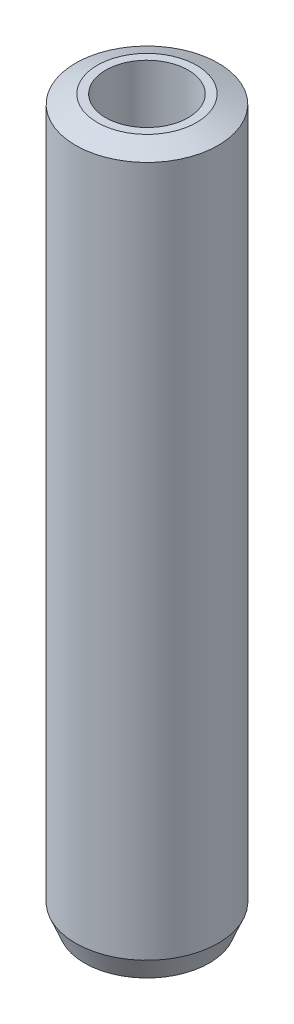
ISO-10303-21;
HEADER;
FILE_DESCRIPTION(('STEP AP214'),'2;1');
FILE_NAME('part.step','',(''),(''),'','','');
FILE_SCHEMA(('AUTOMOTIVE_DESIGN { 1 0 10303 214 1 1 1 1 }'));
ENDSEC;
DATA;
#1=APPLICATION_CONTEXT('core data for automotive mechanical design processes');
#2=APPLICATION_PROTOCOL_DEFINITION('international standard','automotive_design',2000,#1);
#3=PRODUCT_CONTEXT('',#1,'mechanical');
#4=PRODUCT('Part','Part','',(#3));
#5=PRODUCT_RELATED_PRODUCT_CATEGORY('part','',(#4));
#6=PRODUCT_DEFINITION_FORMATION('','',#4);
#7=PRODUCT_DEFINITION_CONTEXT('part definition',#1,'design');
#8=PRODUCT_DEFINITION('design','',#6,#7);
#9=PRODUCT_DEFINITION_SHAPE('','',#8);
#10=(LENGTH_UNIT() NAMED_UNIT(*) SI_UNIT(.MILLI.,.METRE.));
#11=(NAMED_UNIT(*) PLANE_ANGLE_UNIT() SI_UNIT($,.RADIAN.));
#12=(NAMED_UNIT(*) SI_UNIT($,.STERADIAN.) SOLID_ANGLE_UNIT());
#13=UNCERTAINTY_MEASURE_WITH_UNIT(LENGTH_MEASURE(1.E-05),#10,'distance_accuracy_value','');
#14=(GEOMETRIC_REPRESENTATION_CONTEXT(3) GLOBAL_UNCERTAINTY_ASSIGNED_CONTEXT((#13)) GLOBAL_UNIT_ASSIGNED_CONTEXT((#10,
#11,#12)) REPRESENTATION_CONTEXT('',''));
#15=CARTESIAN_POINT('',(0.,0.,0.));
#16=DIRECTION('',(0.,0.,1.));
#17=DIRECTION('',(1.,0.,0.));
#18=AXIS2_PLACEMENT_3D('',#15,#16,#17);
#19=CARTESIAN_POINT('',(0.,480.630335309219,0.));
#20=DIRECTION('',(0.,-1.,0.));
#21=DIRECTION('',(0.,0.,-1.));
#22=AXIS2_PLACEMENT_3D('',#19,#20,#21);
#23=CYLINDRICAL_SURFACE('',#22,47.5);
#24=CARTESIAN_POINT('',(0.,474.67004236578,0.));
#25=DIRECTION('',(0.,1.,0.));
#26=DIRECTION('',(0.,0.,1.));
#27=AXIS2_PLACEMENT_3D('',#24,#25,#26);
#28=CIRCLE('',#27,47.5);
#29=CARTESIAN_POINT('',(0.,474.67004236578,47.5));
#30=VERTEX_POINT('',#29);
#31=EDGE_CURVE('E50',#30,#30,#28,.F.);
#32=ORIENTED_EDGE('',*,*,#31,.T.);
#33=EDGE_LOOP('',(#32));
#34=FACE_BOUND('',#33,.T.);
#35=CARTESIAN_POINT('',(0.,14.4413413422947,0.));
#36=DIRECTION('',(0.,1.,0.));
#37=DIRECTION('',(0.,0.,1.));
#38=AXIS2_PLACEMENT_3D('',#35,#36,#37);
#39=CIRCLE('',#38,47.5);
#40=CARTESIAN_POINT('',(0.,14.4413413422947,47.5));
#41=VERTEX_POINT('',#40);
#42=EDGE_CURVE('E51',#41,#41,#39,.T.);
#43=ORIENTED_EDGE('',*,*,#42,.T.);
#44=EDGE_LOOP('',(#43));
#45=FACE_BOUND('',#44,.T.);
#46=ADVANCED_FACE('F39',(#34,#45),#23,.T.);
#47=CARTESIAN_POINT('',(0.,480.630335309219,0.));
#48=DIRECTION('',(0.,1.,0.));
#49=DIRECTION('',(0.,0.,1.));
#50=AXIS2_PLACEMENT_3D('',#47,#48,#49);
#51=PLANE('',#50);
#52=CARTESIAN_POINT('',(0.,480.630335309219,0.));
#53=DIRECTION('',(0.,1.,0.));
#54=DIRECTION('',(0.,0.,1.));
#55=AXIS2_PLACEMENT_3D('',#52,#53,#54);
#56=CIRCLE('',#55,33.0586586577051);
#57=CARTESIAN_POINT('',(0.,480.630335309219,33.0586586577051));
#58=VERTEX_POINT('',#57);
#59=EDGE_CURVE('E54',#58,#58,#56,.T.);
#60=ORIENTED_EDGE('',*,*,#59,.T.);
#61=EDGE_LOOP('',(#60));
#62=FACE_BOUND('',#61,.T.);
#63=CARTESIAN_POINT('',(0.,480.630335309219,0.));
#64=DIRECTION('',(0.,1.,0.));
#65=DIRECTION('',(0.,0.,1.));
#66=AXIS2_PLACEMENT_3D('',#63,#64,#65);
#67=CIRCLE('',#66,27.4800026832369);
#68=CARTESIAN_POINT('',(0.,480.630335309219,27.4800026832369));
#69=VERTEX_POINT('',#68);
#70=EDGE_CURVE('E58',#69,#69,#67,.T.);
#71=ORIENTED_EDGE('',*,*,#70,.F.);
#72=EDGE_LOOP('',(#71));
#73=FACE_BOUND('',#72,.T.);
#74=ADVANCED_FACE('F69',(#62,#73),#51,.T.);
#75=CARTESIAN_POINT('',(0.,0.,0.));
#76=DIRECTION('',(0.,1.,0.));
#77=DIRECTION('',(0.,0.,1.));
#78=AXIS2_PLACEMENT_3D('',#75,#76,#77);
#79=PLANE('',#78);
#80=CARTESIAN_POINT('',(0.,0.,0.));
#81=DIRECTION('',(0.,1.,0.));
#82=DIRECTION('',(0.,0.,1.));
#83=AXIS2_PLACEMENT_3D('',#80,#81,#82);
#84=CIRCLE('',#83,41.5397070565612);
#85=CARTESIAN_POINT('',(0.,0.,41.5397070565612));
#86=VERTEX_POINT('',#85);
#87=EDGE_CURVE('E10',#86,#86,#84,.F.);
#88=ORIENTED_EDGE('',*,*,#87,.T.);
#89=EDGE_LOOP('',(#88));
#90=FACE_BOUND('',#89,.T.);
#91=CARTESIAN_POINT('',(0.,0.,0.));
#92=DIRECTION('',(0.,1.,0.));
#93=DIRECTION('',(0.,0.,1.));
#94=AXIS2_PLACEMENT_3D('',#91,#92,#93);
#95=CIRCLE('',#94,27.4800026832369);
#96=CARTESIAN_POINT('',(0.,0.,27.4800026832369));
#97=VERTEX_POINT('',#96);
#98=EDGE_CURVE('E63',#97,#97,#95,.T.);
#99=ORIENTED_EDGE('',*,*,#98,.T.);
#100=EDGE_LOOP('',(#99));
#101=FACE_BOUND('',#100,.T.);
#102=ADVANCED_FACE('F75',(#90,#101),#79,.F.);
#103=CARTESIAN_POINT('',(0.,480.630335309219,0.));
#104=DIRECTION('',(0.,-1.,0.));
#105=DIRECTION('',(0.,0.,-1.));
#106=AXIS2_PLACEMENT_3D('',#103,#104,#105);
#107=CYLINDRICAL_SURFACE('',#106,27.4800026832369);
#108=ORIENTED_EDGE('',*,*,#70,.T.);
#109=EDGE_LOOP('',(#108));
#110=FACE_BOUND('',#109,.T.);
#111=ORIENTED_EDGE('',*,*,#98,.F.);
#112=EDGE_LOOP('',(#111));
#113=FACE_BOUND('',#112,.T.);
#114=ADVANCED_FACE('F70',(#110,#113),#107,.F.);
#115=CARTESIAN_POINT('',(0.,480.630335309219,0.));
#116=DIRECTION('',(0.,-1.,0.));
#117=DIRECTION('',(0.,0.,-1.));
#118=AXIS2_PLACEMENT_3D('',#115,#116,#117);
#119=CONICAL_SURFACE('',#118,33.0586586577051,1.17936905258179);
#120=ORIENTED_EDGE('',*,*,#31,.F.);
#121=EDGE_LOOP('',(#120));
#122=FACE_BOUND('',#121,.T.);
#123=ORIENTED_EDGE('',*,*,#59,.F.);
#124=EDGE_LOOP('',(#123));
#125=FACE_BOUND('',#124,.T.);
#126=ADVANCED_FACE('F81',(#122,#125),#119,.T.);
#127=CARTESIAN_POINT('',(0.,14.4413413422947,0.));
#128=DIRECTION('',(0.,1.,0.));
#129=DIRECTION('',(0.,0.,1.));
#130=AXIS2_PLACEMENT_3D('',#127,#128,#129);
#131=CONICAL_SURFACE('',#130,47.5,0.391427274213104);
#132=ORIENTED_EDGE('',*,*,#87,.F.);
#133=EDGE_LOOP('',(#132));
#134=FACE_BOUND('',#133,.T.);
#135=ORIENTED_EDGE('',*,*,#42,.F.);
#136=EDGE_LOOP('',(#135));
#137=FACE_BOUND('',#136,.T.);
#138=ADVANCED_FACE('F45',(#134,#137),#131,.T.);
#139=CLOSED_SHELL('',(#46,#74,#102,#114,#126,#138));
#140=MANIFOLD_SOLID_BREP('B2',#139);
#141=ADVANCED_BREP_SHAPE_REPRESENTATION('',(#18,#140),#14);
#142=SHAPE_DEFINITION_REPRESENTATION(#9,#141);
ENDSEC;
END-ISO-10303-21;
